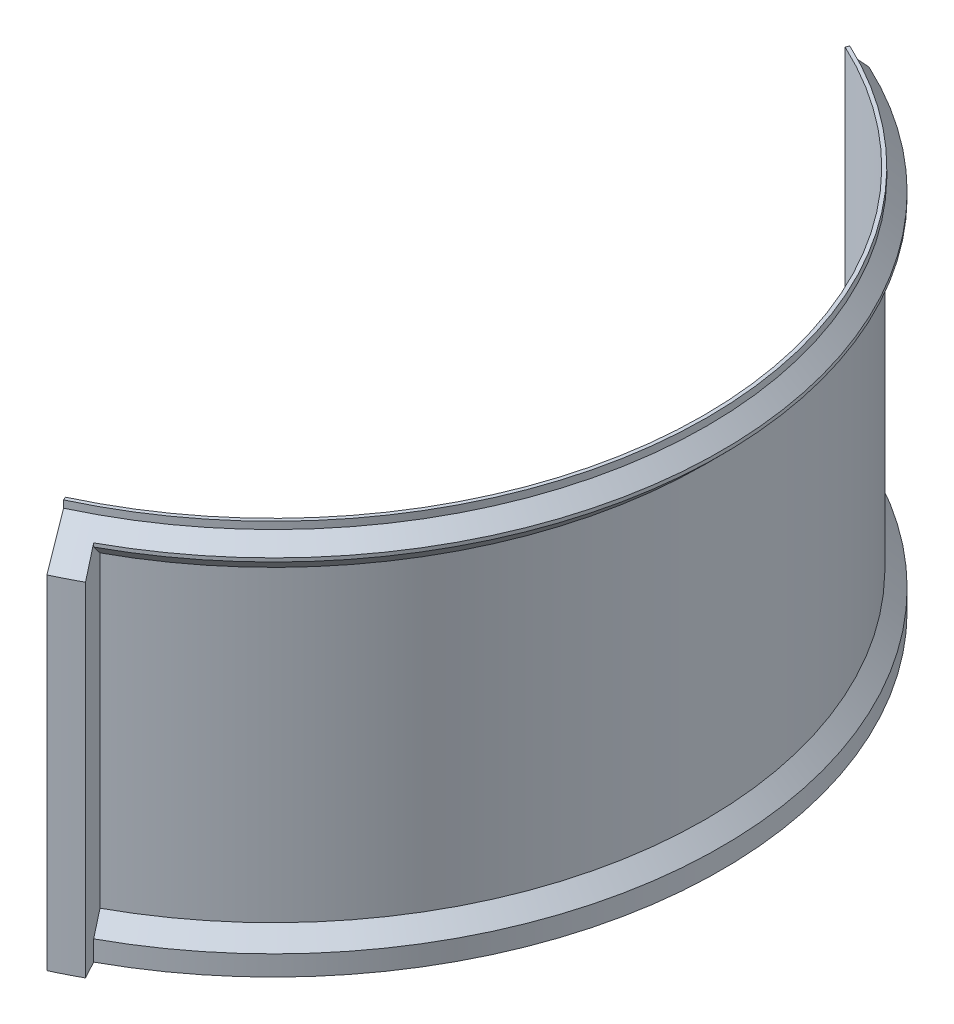
ISO-10303-21;
HEADER;
FILE_DESCRIPTION(('STEP AP214'),'2;1');
FILE_NAME('part.step','',(''),(''),'','','');
FILE_SCHEMA(('AUTOMOTIVE_DESIGN { 1 0 10303 214 1 1 1 1 }'));
ENDSEC;
DATA;
#1=APPLICATION_CONTEXT('core data for automotive mechanical design processes');
#2=APPLICATION_PROTOCOL_DEFINITION('international standard','automotive_design',2000,#1);
#3=PRODUCT_CONTEXT('',#1,'mechanical');
#4=PRODUCT('Part','Part','',(#3));
#5=PRODUCT_RELATED_PRODUCT_CATEGORY('part','',(#4));
#6=PRODUCT_DEFINITION_FORMATION('','',#4);
#7=PRODUCT_DEFINITION_CONTEXT('part definition',#1,'design');
#8=PRODUCT_DEFINITION('design','',#6,#7);
#9=PRODUCT_DEFINITION_SHAPE('','',#8);
#10=(LENGTH_UNIT() NAMED_UNIT(*) SI_UNIT(.MILLI.,.METRE.));
#11=(NAMED_UNIT(*) PLANE_ANGLE_UNIT() SI_UNIT($,.RADIAN.));
#12=(NAMED_UNIT(*) SI_UNIT($,.STERADIAN.) SOLID_ANGLE_UNIT());
#13=UNCERTAINTY_MEASURE_WITH_UNIT(LENGTH_MEASURE(1.E-05),#10,'distance_accuracy_value','');
#14=(GEOMETRIC_REPRESENTATION_CONTEXT(3) GLOBAL_UNCERTAINTY_ASSIGNED_CONTEXT((#13)) GLOBAL_UNIT_ASSIGNED_CONTEXT((#10,
#11,#12)) REPRESENTATION_CONTEXT('',''));
#15=CARTESIAN_POINT('',(0.,0.,0.));
#16=DIRECTION('',(0.,0.,1.));
#17=DIRECTION('',(1.,0.,0.));
#18=AXIS2_PLACEMENT_3D('',#15,#16,#17);
#19=CARTESIAN_POINT('',(0.,-0.199999999999984,0.));
#20=DIRECTION('',(0.,-1.,0.));
#21=DIRECTION('',(0.,0.,-1.));
#22=AXIS2_PLACEMENT_3D('',#19,#20,#21);
#23=CONICAL_SURFACE('',#22,124.66074369328,0.785398163397449);
#24=DIRECTION('',(-0.337615830963898,0.707106781186547,-0.621301497408913));
#25=VECTOR('',#24,1.);
#26=CARTESIAN_POINT('',(0.,124.460743693279,0.));
#27=LINE('',#26,#25);
#28=CARTESIAN_POINT('',(59.5206292604917,-0.199999999999984,109.533536921788));
#29=VERTEX_POINT('',#28);
#30=CARTESIAN_POINT('',(57.4436744019503,4.14999999999999,105.711396354569));
#31=VERTEX_POINT('',#30);
#32=EDGE_CURVE('E267',#29,#31,#27,.T.);
#33=ORIENTED_EDGE('',*,*,#32,.F.);
#34=CARTESIAN_POINT('',(0.,-0.199999999999984,0.));
#35=DIRECTION('',(0.,1.,0.));
#36=DIRECTION('',(0.,0.,1.));
#37=AXIS2_PLACEMENT_3D('',#34,#35,#36);
#38=CIRCLE('',#37,124.66074369328);
#39=CARTESIAN_POINT('',(52.6839068069564,-0.199999999999984,-112.981002746999));
#40=VERTEX_POINT('',#39);
#41=EDGE_CURVE('E361',#29,#40,#38,.T.);
#42=ORIENTED_EDGE('',*,*,#41,.T.);
#43=DIRECTION('',(-0.298836238730119,0.707106781186546,0.640856382055791));
#44=VECTOR('',#43,1.);
#45=CARTESIAN_POINT('',(52.6839068069564,-0.199999999999984,-112.981002746999));
#46=LINE('',#45,#44);
#47=CARTESIAN_POINT('',(52.5993831546083,0.,-112.799741189592));
#48=VERTEX_POINT('',#47);
#49=EDGE_CURVE('E295',#40,#48,#46,.T.);
#50=ORIENTED_EDGE('',*,*,#49,.T.);
#51=CARTESIAN_POINT('',(0.,0.,0.));
#52=DIRECTION('',(0.,1.,0.));
#53=DIRECTION('',(0.,0.,1.));
#54=AXIS2_PLACEMENT_3D('',#51,#52,#53);
#55=CIRCLE('',#54,124.46074369328);
#56=CARTESIAN_POINT('',(59.7297907356549,0.,-109.191706733429));
#57=VERTEX_POINT('',#56);
#58=EDGE_CURVE('E50',#57,#48,#55,.T.);
#59=ORIENTED_EDGE('',*,*,#58,.F.);
#60=DIRECTION('',(0.339346679239839,-0.707106781186547,-0.620357825201629));
#61=VECTOR('',#60,1.);
#62=CARTESIAN_POINT('',(-2.73942883978465E-13,124.460743693279,-1.49851592424521E-13));
#63=LINE('',#62,#61);
#64=CARTESIAN_POINT('',(57.7381697297268,4.14999999999996,-105.550835166243));
#65=VERTEX_POINT('',#64);
#66=EDGE_CURVE('E54',#65,#57,#63,.T.);
#67=ORIENTED_EDGE('',*,*,#66,.F.);
#68=CARTESIAN_POINT('',(0.,4.14999999999996,0.));
#69=DIRECTION('',(0.,-1.,0.));
#70=DIRECTION('',(0.,0.,-1.));
#71=AXIS2_PLACEMENT_3D('',#68,#69,#70);
#72=CIRCLE('',#71,120.31074369328);
#73=CARTESIAN_POINT('',(50.8455173683844,4.15000000000003,-109.03856387339));
#74=VERTEX_POINT('',#73);
#75=EDGE_CURVE('E242',#74,#65,#72,.T.);
#76=ORIENTED_EDGE('',*,*,#75,.F.);
#77=CARTESIAN_POINT('',(50.8243864552973,4.2,-108.993248484038));
#78=VERTEX_POINT('',#77);
#79=EDGE_CURVE('E294',#74,#78,#46,.T.);
#80=ORIENTED_EDGE('',*,*,#79,.T.);
#81=CARTESIAN_POINT('',(0.,4.2,0.));
#82=DIRECTION('',(0.,1.,0.));
#83=DIRECTION('',(0.,0.,1.));
#84=AXIS2_PLACEMENT_3D('',#81,#82,#83);
#85=CIRCLE('',#84,120.26074369328);
#86=CARTESIAN_POINT('',(50.8243864552974,4.2,108.993248484038));
#87=VERTEX_POINT('',#86);
#88=EDGE_CURVE('E358',#87,#78,#85,.T.);
#89=ORIENTED_EDGE('',*,*,#88,.F.);
#90=DIRECTION('',(-0.298836238730119,0.707106781186546,-0.640856382055791));
#91=VECTOR('',#90,1.);
#92=CARTESIAN_POINT('',(52.6839068069564,-0.199999999999984,112.981002746999));
#93=LINE('',#92,#91);
#94=CARTESIAN_POINT('',(50.8455173683844,4.15000000000007,109.03856387339));
#95=VERTEX_POINT('',#94);
#96=EDGE_CURVE('E201',#95,#87,#93,.T.);
#97=ORIENTED_EDGE('',*,*,#96,.F.);
#98=CARTESIAN_POINT('',(0.,4.14999999999999,0.));
#99=DIRECTION('',(0.,-1.,0.));
#100=DIRECTION('',(0.,0.,-1.));
#101=AXIS2_PLACEMENT_3D('',#98,#99,#100);
#102=CIRCLE('',#101,120.31074369328);
#103=EDGE_CURVE('E259',#31,#95,#102,.T.);
#104=ORIENTED_EDGE('',*,*,#103,.F.);
#105=EDGE_LOOP('',(#33,#42,#50,#59,#67,#76,#80,#89,#97,#104));
#106=FACE_BOUND('',#105,.T.);
#107=ADVANCED_FACE('F35',(#106),#23,.T.);
#108=CARTESIAN_POINT('',(0.,0.,0.));
#109=DIRECTION('',(0.,1.,0.));
#110=DIRECTION('',(0.,0.,1.));
#111=AXIS2_PLACEMENT_3D('',#108,#109,#110);
#112=CYLINDRICAL_SURFACE('',#111,124.66074369328);
#113=DIRECTION('',(0.,1.,0.));
#114=VECTOR('',#113,1.);
#115=CARTESIAN_POINT('',(59.5206292604917,0.,109.533536921788));
#116=LINE('',#115,#114);
#117=CARTESIAN_POINT('',(59.5206292604917,-5.8,109.533536921788));
#118=VERTEX_POINT('',#117);
#119=EDGE_CURVE('E217',#118,#29,#116,.T.);
#120=ORIENTED_EDGE('',*,*,#119,.F.);
#121=CARTESIAN_POINT('',(0.,-5.8,0.));
#122=DIRECTION('',(0.,1.,0.));
#123=DIRECTION('',(0.,0.,1.));
#124=AXIS2_PLACEMENT_3D('',#121,#122,#123);
#125=CIRCLE('',#124,124.66074369328);
#126=CARTESIAN_POINT('',(52.6839068069564,-5.8,-112.981002746999));
#127=VERTEX_POINT('',#126);
#128=EDGE_CURVE('E363',#118,#127,#125,.T.);
#129=ORIENTED_EDGE('',*,*,#128,.T.);
#130=DIRECTION('',(0.,1.,0.));
#131=VECTOR('',#130,1.);
#132=CARTESIAN_POINT('',(52.6839068069564,-5.8,-112.981002746999));
#133=LINE('',#132,#131);
#134=EDGE_CURVE('E291',#127,#40,#133,.T.);
#135=ORIENTED_EDGE('',*,*,#134,.T.);
#136=ORIENTED_EDGE('',*,*,#41,.F.);
#137=EDGE_LOOP('',(#120,#129,#135,#136));
#138=FACE_BOUND('',#137,.T.);
#139=ADVANCED_FACE('F418',(#138),#112,.T.);
#140=CARTESIAN_POINT('',(0.,89.8,0.));
#141=DIRECTION('',(0.,1.,0.));
#142=DIRECTION('',(0.,0.,1.));
#143=AXIS2_PLACEMENT_3D('',#140,#141,#142);
#144=CONICAL_SURFACE('',#143,120.26074369328,0.785398163397436);
#145=DIRECTION('',(-0.339346679239835,-0.707106781186557,0.62035782520162));
#146=VECTOR('',#145,1.);
#147=CARTESIAN_POINT('',(-2.73942883978465E-13,-30.4607436932827,-1.49851592424521E-13));
#148=LINE('',#147,#146);
#149=CARTESIAN_POINT('',(59.8257724708803,94.2000000000001,-109.367170423414));
#150=VERTEX_POINT('',#149);
#151=CARTESIAN_POINT('',(57.7381697297268,89.85,-105.550835166242));
#152=VERTEX_POINT('',#151);
#153=EDGE_CURVE('E245',#150,#152,#148,.T.);
#154=ORIENTED_EDGE('',*,*,#153,.F.);
#155=CARTESIAN_POINT('',(0.,94.2000000000001,0.));
#156=DIRECTION('',(0.,1.,0.));
#157=DIRECTION('',(0.,0.,1.));
#158=AXIS2_PLACEMENT_3D('',#155,#156,#157);
#159=CIRCLE('',#158,124.66074369328);
#160=CARTESIAN_POINT('',(59.5206292604917,94.2000000000001,109.533536921788));
#161=VERTEX_POINT('',#160);
#162=EDGE_CURVE('E353',#161,#150,#159,.T.);
#163=ORIENTED_EDGE('',*,*,#162,.F.);
#164=DIRECTION('',(0.337615830963894,0.707106781186557,0.621301497408905));
#165=VECTOR('',#164,1.);
#166=CARTESIAN_POINT('',(0.,-30.4607436932827,0.));
#167=LINE('',#166,#165);
#168=CARTESIAN_POINT('',(57.4436744019503,89.85,105.711396354569));
#169=VERTEX_POINT('',#168);
#170=EDGE_CURVE('E265',#169,#161,#167,.T.);
#171=ORIENTED_EDGE('',*,*,#170,.F.);
#172=CARTESIAN_POINT('',(0.,89.85,0.));
#173=DIRECTION('',(0.,1.,0.));
#174=DIRECTION('',(0.,0.,1.));
#175=AXIS2_PLACEMENT_3D('',#172,#173,#174);
#176=CIRCLE('',#175,120.31074369328);
#177=CARTESIAN_POINT('',(50.8455173683844,89.85,109.03856387339));
#178=VERTEX_POINT('',#177);
#179=EDGE_CURVE('E250',#178,#169,#176,.T.);
#180=ORIENTED_EDGE('',*,*,#179,.F.);
#181=DIRECTION('',(0.298836238730115,0.707106781186555,0.640856382055782));
#182=VECTOR('',#181,1.);
#183=CARTESIAN_POINT('',(50.8243864552974,89.8,108.993248484038));
#184=LINE('',#183,#182);
#185=CARTESIAN_POINT('',(50.8243864552974,89.8,108.993248484038));
#186=VERTEX_POINT('',#185);
#187=EDGE_CURVE('E334',#186,#178,#184,.T.);
#188=ORIENTED_EDGE('',*,*,#187,.F.);
#189=CARTESIAN_POINT('',(0.,89.8,0.));
#190=DIRECTION('',(0.,1.,0.));
#191=DIRECTION('',(0.,0.,1.));
#192=AXIS2_PLACEMENT_3D('',#189,#190,#191);
#193=CIRCLE('',#192,120.26074369328);
#194=CARTESIAN_POINT('',(50.8243864552973,89.8,-108.993248484038));
#195=VERTEX_POINT('',#194);
#196=EDGE_CURVE('E356',#186,#195,#193,.T.);
#197=ORIENTED_EDGE('',*,*,#196,.T.);
#198=DIRECTION('',(0.298836238730115,0.707106781186555,-0.640856382055782));
#199=VECTOR('',#198,1.);
#200=CARTESIAN_POINT('',(50.8243864552973,89.8,-108.993248484038));
#201=LINE('',#200,#199);
#202=CARTESIAN_POINT('',(50.8455173683844,89.85,-109.03856387339));
#203=VERTEX_POINT('',#202);
#204=EDGE_CURVE('E300',#195,#203,#201,.T.);
#205=ORIENTED_EDGE('',*,*,#204,.T.);
#206=CARTESIAN_POINT('',(0.,89.85,0.));
#207=DIRECTION('',(0.,1.,0.));
#208=DIRECTION('',(0.,0.,1.));
#209=AXIS2_PLACEMENT_3D('',#206,#207,#208);
#210=CIRCLE('',#209,120.31074369328);
#211=EDGE_CURVE('E240',#152,#203,#210,.T.);
#212=ORIENTED_EDGE('',*,*,#211,.F.);
#213=EDGE_LOOP('',(#154,#163,#171,#180,#188,#197,#205,#212));
#214=FACE_BOUND('',#213,.T.);
#215=ADVANCED_FACE('F436',(#214),#144,.T.);
#216=CARTESIAN_POINT('',(0.,0.,0.));
#217=DIRECTION('',(0.,1.,0.));
#218=DIRECTION('',(0.,0.,1.));
#219=AXIS2_PLACEMENT_3D('',#216,#217,#218);
#220=CYLINDRICAL_SURFACE('',#219,124.66074369328);
#221=DIRECTION('',(0.,1.,0.));
#222=VECTOR('',#221,1.);
#223=CARTESIAN_POINT('',(52.6839068069564,94.2000000000001,-112.981002746999));
#224=LINE('',#223,#222);
#225=CARTESIAN_POINT('',(52.6839068069564,0.,-112.981002746999));
#226=VERTEX_POINT('',#225);
#227=CARTESIAN_POINT('',(52.6839068069564,95.2000000000001,-112.981002746999));
#228=VERTEX_POINT('',#227);
#229=EDGE_CURVE('E303',#226,#228,#224,.T.);
#230=ORIENTED_EDGE('',*,*,#229,.T.);
#231=CARTESIAN_POINT('',(0.,95.2000000000001,0.));
#232=DIRECTION('',(0.,1.,0.));
#233=DIRECTION('',(0.,0.,1.));
#234=AXIS2_PLACEMENT_3D('',#231,#232,#233);
#235=CIRCLE('',#234,124.66074369328);
#236=CARTESIAN_POINT('',(59.5206292604916,95.2000000000001,109.533536921788));
#237=VERTEX_POINT('',#236);
#238=EDGE_CURVE('E351',#237,#228,#235,.T.);
#239=ORIENTED_EDGE('',*,*,#238,.F.);
#240=DIRECTION('',(0.,1.,0.));
#241=VECTOR('',#240,1.);
#242=CARTESIAN_POINT('',(59.5206292604917,0.,109.533536921788));
#243=LINE('',#242,#241);
#244=EDGE_CURVE('E262',#161,#237,#243,.T.);
#245=ORIENTED_EDGE('',*,*,#244,.F.);
#246=ORIENTED_EDGE('',*,*,#162,.T.);
#247=DIRECTION('',(0.,-1.,0.));
#248=VECTOR('',#247,1.);
#249=CARTESIAN_POINT('',(59.8257724708803,102.557009926228,-109.367170423414));
#250=LINE('',#249,#248);
#251=CARTESIAN_POINT('',(59.8257724708803,0.,-109.367170423414));
#252=VERTEX_POINT('',#251);
#253=EDGE_CURVE('E231',#150,#252,#250,.T.);
#254=ORIENTED_EDGE('',*,*,#253,.T.);
#255=CARTESIAN_POINT('',(0.,0.,0.));
#256=DIRECTION('',(0.,1.,0.));
#257=DIRECTION('',(0.,0.,1.));
#258=AXIS2_PLACEMENT_3D('',#255,#256,#257);
#259=CIRCLE('',#258,124.66074369328);
#260=EDGE_CURVE('E220',#252,#226,#259,.T.);
#261=ORIENTED_EDGE('',*,*,#260,.T.);
#262=EDGE_LOOP('',(#230,#239,#245,#246,#254,#261));
#263=FACE_BOUND('',#262,.T.);
#264=ADVANCED_FACE('F407',(#263),#220,.T.);
#265=CARTESIAN_POINT('',(0.,0.,0.));
#266=DIRECTION('',(0.,1.,0.));
#267=DIRECTION('',(0.,0.,1.));
#268=AXIS2_PLACEMENT_3D('',#265,#266,#267);
#269=CYLINDRICAL_SURFACE('',#268,119.66074369328);
#270=CARTESIAN_POINT('',(0.,-5.8,0.));
#271=DIRECTION('',(0.,1.,0.));
#272=DIRECTION('',(0.,0.,1.));
#273=AXIS2_PLACEMENT_3D('',#270,#271,#272);
#274=CIRCLE('',#273,119.66074369328);
#275=CARTESIAN_POINT('',(50.5708154982529,-5.8,108.449463811816));
#276=VERTEX_POINT('',#275);
#277=CARTESIAN_POINT('',(50.5708154982529,-5.8,-108.449463811816));
#278=VERTEX_POINT('',#277);
#279=EDGE_CURVE('E11',#276,#278,#274,.T.);
#280=ORIENTED_EDGE('',*,*,#279,.F.);
#281=DIRECTION('',(0.,-1.,0.));
#282=VECTOR('',#281,1.);
#283=CARTESIAN_POINT('',(50.5708154982529,101.2,108.449463811816));
#284=LINE('',#283,#282);
#285=CARTESIAN_POINT('',(50.5708154982529,101.2,108.449463811816));
#286=VERTEX_POINT('',#285);
#287=EDGE_CURVE('E315',#286,#276,#284,.T.);
#288=ORIENTED_EDGE('',*,*,#287,.F.);
#289=CARTESIAN_POINT('',(0.,101.2,0.));
#290=DIRECTION('',(0.,1.,0.));
#291=DIRECTION('',(0.,0.,1.));
#292=AXIS2_PLACEMENT_3D('',#289,#290,#291);
#293=CIRCLE('',#292,119.66074369328);
#294=CARTESIAN_POINT('',(50.5708154982529,101.2,-108.449463811816));
#295=VERTEX_POINT('',#294);
#296=EDGE_CURVE('E345',#286,#295,#293,.T.);
#297=ORIENTED_EDGE('',*,*,#296,.T.);
#298=DIRECTION('',(0.,-1.,0.));
#299=VECTOR('',#298,1.);
#300=CARTESIAN_POINT('',(50.5708154982529,101.2,-108.449463811816));
#301=LINE('',#300,#299);
#302=EDGE_CURVE('E270',#295,#278,#301,.T.);
#303=ORIENTED_EDGE('',*,*,#302,.T.);
#304=EDGE_LOOP('',(#280,#288,#297,#303));
#305=FACE_BOUND('',#304,.T.);
#306=ADVANCED_FACE('F392',(#305),#269,.F.);
#307=CARTESIAN_POINT('',(50.5708154982529,-5.8,108.449463811816));
#308=DIRECTION('',(0.,1.,0.));
#309=DIRECTION('',(0.,0.,1.));
#310=AXIS2_PLACEMENT_3D('',#307,#308,#309);
#311=PLANE('',#310);
#312=CARTESIAN_POINT('',(0.,-5.8,0.));
#313=DIRECTION('',(0.,1.,0.));
#314=DIRECTION('',(0.,0.,1.));
#315=AXIS2_PLACEMENT_3D('',#312,#313,#314);
#316=CIRCLE('',#315,120.66074369328);
#317=CARTESIAN_POINT('',(50.9934337599936,-5.8,109.355771598853));
#318=VERTEX_POINT('',#317);
#319=CARTESIAN_POINT('',(50.9934337599936,-5.8,-109.355771598853));
#320=VERTEX_POINT('',#319);
#321=EDGE_CURVE('E43',#318,#320,#316,.T.);
#322=ORIENTED_EDGE('',*,*,#321,.F.);
#323=DIRECTION('',(0.422618261740697,0.,0.906307787036651));
#324=VECTOR('',#323,1.);
#325=CARTESIAN_POINT('',(50.5708154982529,-5.8,108.449463811816));
#326=LINE('',#325,#324);
#327=EDGE_CURVE('E318',#276,#318,#326,.T.);
#328=ORIENTED_EDGE('',*,*,#327,.F.);
#329=ORIENTED_EDGE('',*,*,#279,.T.);
#330=DIRECTION('',(0.422618261740697,0.,-0.906307787036651));
#331=VECTOR('',#330,1.);
#332=CARTESIAN_POINT('',(50.5708154982529,-5.8,-108.449463811816));
#333=LINE('',#332,#331);
#334=EDGE_CURVE('E273',#278,#320,#333,.T.);
#335=ORIENTED_EDGE('',*,*,#334,.T.);
#336=EDGE_LOOP('',(#322,#328,#329,#335));
#337=FACE_BOUND('',#336,.T.);
#338=ADVANCED_FACE('F37',(#337),#311,.F.);
#339=CARTESIAN_POINT('',(0.,0.,0.));
#340=DIRECTION('',(0.,1.,0.));
#341=DIRECTION('',(0.,0.,1.));
#342=AXIS2_PLACEMENT_3D('',#339,#340,#341);
#343=CYLINDRICAL_SURFACE('',#342,120.66074369328);
#344=CARTESIAN_POINT('',(0.,-2.99999999983649,0.));
#345=DIRECTION('',(0.,1.,0.));
#346=DIRECTION('',(0.,0.,1.));
#347=AXIS2_PLACEMENT_3D('',#344,#345,#346);
#348=CIRCLE('',#347,120.66074369328);
#349=CARTESIAN_POINT('',(50.9934337599936,-2.99999999983649,109.355771598853));
#350=VERTEX_POINT('',#349);
#351=CARTESIAN_POINT('',(50.9934337599936,-2.99999999983649,-109.355771598853));
#352=VERTEX_POINT('',#351);
#353=EDGE_CURVE('E371',#350,#352,#348,.T.);
#354=ORIENTED_EDGE('',*,*,#353,.F.);
#355=DIRECTION('',(0.,1.,0.));
#356=VECTOR('',#355,1.);
#357=CARTESIAN_POINT('',(50.9934337599936,-5.8,109.355771598853));
#358=LINE('',#357,#356);
#359=EDGE_CURVE('E321',#318,#350,#358,.T.);
#360=ORIENTED_EDGE('',*,*,#359,.F.);
#361=ORIENTED_EDGE('',*,*,#321,.T.);
#362=DIRECTION('',(0.,1.,0.));
#363=VECTOR('',#362,1.);
#364=CARTESIAN_POINT('',(50.9934337599936,-5.8,-109.355771598853));
#365=LINE('',#364,#363);
#366=EDGE_CURVE('E276',#320,#352,#365,.T.);
#367=ORIENTED_EDGE('',*,*,#366,.T.);
#368=EDGE_LOOP('',(#354,#360,#361,#367));
#369=FACE_BOUND('',#368,.T.);
#370=ADVANCED_FACE('F374',(#369),#343,.T.);
#371=CARTESIAN_POINT('',(0.,-2.99999999983649,0.));
#372=DIRECTION('',(0.,1.,0.));
#373=DIRECTION('',(0.,0.,1.));
#374=AXIS2_PLACEMENT_3D('',#371,#372,#373);
#375=CONICAL_SURFACE('',#374,120.66074369328,0.785398163397441);
#376=CARTESIAN_POINT('',(0.,-1.84999999983653,0.));
#377=DIRECTION('',(0.,1.,0.));
#378=DIRECTION('',(0.,0.,1.));
#379=AXIS2_PLACEMENT_3D('',#376,#377,#378);
#380=CIRCLE('',#379,121.81074369328);
#381=CARTESIAN_POINT('',(51.4794447609954,-1.84999999983653,110.398025553945));
#382=VERTEX_POINT('',#381);
#383=CARTESIAN_POINT('',(51.4794447609954,-1.84999999983653,-110.398025553945));
#384=VERTEX_POINT('',#383);
#385=EDGE_CURVE('E369',#382,#384,#380,.T.);
#386=ORIENTED_EDGE('',*,*,#385,.F.);
#387=DIRECTION('',(0.298836238730116,0.707106781186552,0.640856382055785));
#388=VECTOR('',#387,1.);
#389=CARTESIAN_POINT('',(50.9934337599936,-2.99999999983649,109.355771598853));
#390=LINE('',#389,#388);
#391=EDGE_CURVE('E324',#350,#382,#390,.T.);
#392=ORIENTED_EDGE('',*,*,#391,.F.);
#393=ORIENTED_EDGE('',*,*,#353,.T.);
#394=DIRECTION('',(0.298836238730116,0.707106781186552,-0.640856382055785));
#395=VECTOR('',#394,1.);
#396=CARTESIAN_POINT('',(50.9934337599936,-2.99999999983649,-109.355771598853));
#397=LINE('',#396,#395);
#398=EDGE_CURVE('E279',#352,#384,#397,.T.);
#399=ORIENTED_EDGE('',*,*,#398,.T.);
#400=EDGE_LOOP('',(#386,#392,#393,#399));
#401=FACE_BOUND('',#400,.T.);
#402=ADVANCED_FACE('F386',(#401),#375,.T.);
#403=CARTESIAN_POINT('',(0.,-1.84999999983653,0.));
#404=DIRECTION('',(0.,-1.,0.));
#405=DIRECTION('',(0.,0.,-1.));
#406=AXIS2_PLACEMENT_3D('',#403,#404,#405);
#407=CONICAL_SURFACE('',#406,121.81074369328,0.785398163397468);
#408=CARTESIAN_POINT('',(0.,-2.99999999983645,0.));
#409=DIRECTION('',(0.,1.,0.));
#410=DIRECTION('',(0.,0.,1.));
#411=AXIS2_PLACEMENT_3D('',#408,#409,#410);
#412=CIRCLE('',#411,122.96074369328);
#413=CARTESIAN_POINT('',(51.9654557619972,-2.99999999983645,111.440279509037));
#414=VERTEX_POINT('',#413);
#415=CARTESIAN_POINT('',(51.9654557619972,-2.99999999983645,-111.440279509037));
#416=VERTEX_POINT('',#415);
#417=EDGE_CURVE('E367',#414,#416,#412,.T.);
#418=ORIENTED_EDGE('',*,*,#417,.F.);
#419=DIRECTION('',(0.298836238730124,-0.707106781186534,0.640856382055802));
#420=VECTOR('',#419,1.);
#421=CARTESIAN_POINT('',(51.4794447609954,-1.84999999983653,110.398025553945));
#422=LINE('',#421,#420);
#423=EDGE_CURVE('E327',#382,#414,#422,.T.);
#424=ORIENTED_EDGE('',*,*,#423,.F.);
#425=ORIENTED_EDGE('',*,*,#385,.T.);
#426=DIRECTION('',(0.298836238730124,-0.707106781186534,-0.640856382055802));
#427=VECTOR('',#426,1.);
#428=CARTESIAN_POINT('',(51.4794447609954,-1.84999999983653,-110.398025553945));
#429=LINE('',#428,#427);
#430=EDGE_CURVE('E282',#384,#416,#429,.T.);
#431=ORIENTED_EDGE('',*,*,#430,.T.);
#432=EDGE_LOOP('',(#418,#424,#425,#431));
#433=FACE_BOUND('',#432,.T.);
#434=ADVANCED_FACE('F422',(#433),#407,.F.);
#435=CARTESIAN_POINT('',(0.,0.,0.));
#436=DIRECTION('',(0.,1.,0.));
#437=DIRECTION('',(0.,0.,1.));
#438=AXIS2_PLACEMENT_3D('',#435,#436,#437);
#439=CYLINDRICAL_SURFACE('',#438,122.96074369328);
#440=CARTESIAN_POINT('',(0.,-5.8,0.));
#441=DIRECTION('',(0.,1.,0.));
#442=DIRECTION('',(0.,0.,1.));
#443=AXIS2_PLACEMENT_3D('',#440,#441,#442);
#444=CIRCLE('',#443,122.96074369328);
#445=CARTESIAN_POINT('',(51.9654557619972,-5.8,111.440279509037));
#446=VERTEX_POINT('',#445);
#447=CARTESIAN_POINT('',(51.9654557619972,-5.8,-111.440279509037));
#448=VERTEX_POINT('',#447);
#449=EDGE_CURVE('E365',#446,#448,#444,.T.);
#450=ORIENTED_EDGE('',*,*,#449,.F.);
#451=DIRECTION('',(0.,-1.,0.));
#452=VECTOR('',#451,1.);
#453=CARTESIAN_POINT('',(51.9654557619972,-2.99999999983645,111.440279509037));
#454=LINE('',#453,#452);
#455=EDGE_CURVE('E198',#414,#446,#454,.T.);
#456=ORIENTED_EDGE('',*,*,#455,.F.);
#457=ORIENTED_EDGE('',*,*,#417,.T.);
#458=DIRECTION('',(0.,-1.,0.));
#459=VECTOR('',#458,1.);
#460=CARTESIAN_POINT('',(51.9654557619972,-2.99999999983645,-111.440279509037));
#461=LINE('',#460,#459);
#462=EDGE_CURVE('E285',#416,#448,#461,.T.);
#463=ORIENTED_EDGE('',*,*,#462,.T.);
#464=EDGE_LOOP('',(#450,#456,#457,#463));
#465=FACE_BOUND('',#464,.T.);
#466=ADVANCED_FACE('F420',(#465),#439,.F.);
#467=CARTESIAN_POINT('',(51.9654557619972,-5.8,111.440279509037));
#468=DIRECTION('',(0.,1.,0.));
#469=DIRECTION('',(0.,0.,1.));
#470=AXIS2_PLACEMENT_3D('',#467,#468,#469);
#471=PLANE('',#470);
#472=ORIENTED_EDGE('',*,*,#128,.F.);
#473=DIRECTION('',(-0.477460887021004,0.,-0.878653003958398));
#474=VECTOR('',#473,1.);
#475=CARTESIAN_POINT('',(59.4251370830875,-5.8,109.357806320996));
#476=LINE('',#475,#474);
#477=CARTESIAN_POINT('',(62.2182832721603,-5.8,114.497926394153));
#478=VERTEX_POINT('',#477);
#479=EDGE_CURVE('E216',#478,#118,#476,.T.);
#480=ORIENTED_EDGE('',*,*,#479,.F.);
#481=CARTESIAN_POINT('',(0.,-5.8,0.));
#482=DIRECTION('',(0.,1.,0.));
#483=DIRECTION('',(0.,0.,1.));
#484=AXIS2_PLACEMENT_3D('',#481,#482,#483);
#485=CIRCLE('',#484,130.31074369328);
#486=CARTESIAN_POINT('',(55.0716999857914,-5.8,118.101641743756));
#487=VERTEX_POINT('',#486);
#488=EDGE_CURVE('E207',#487,#478,#485,.T.);
#489=ORIENTED_EDGE('',*,*,#488,.F.);
#490=DIRECTION('',(0.422618261740697,0.,0.906307787036651));
#491=VECTOR('',#490,1.);
#492=CARTESIAN_POINT('',(51.9654557619972,-5.8,111.440279509037));
#493=LINE('',#492,#491);
#494=EDGE_CURVE('E189',#446,#487,#493,.T.);
#495=ORIENTED_EDGE('',*,*,#494,.F.);
#496=ORIENTED_EDGE('',*,*,#449,.T.);
#497=DIRECTION('',(0.422618261740697,0.,-0.906307787036651));
#498=VECTOR('',#497,1.);
#499=CARTESIAN_POINT('',(51.9654557619972,-5.8,-111.440279509037));
#500=LINE('',#499,#498);
#501=EDGE_CURVE('E288',#448,#127,#500,.T.);
#502=ORIENTED_EDGE('',*,*,#501,.T.);
#503=EDGE_LOOP('',(#472,#480,#489,#495,#496,#502));
#504=FACE_BOUND('',#503,.T.);
#505=ADVANCED_FACE('F215',(#504),#471,.F.);
#506=CARTESIAN_POINT('',(0.,0.,0.));
#507=DIRECTION('',(0.,1.,0.));
#508=DIRECTION('',(0.,0.,1.));
#509=AXIS2_PLACEMENT_3D('',#506,#507,#508);
#510=CYLINDRICAL_SURFACE('',#509,120.26074369328);
#511=ORIENTED_EDGE('',*,*,#196,.F.);
#512=DIRECTION('',(0.,1.,0.));
#513=VECTOR('',#512,1.);
#514=CARTESIAN_POINT('',(50.8243864552974,4.2,108.993248484038));
#515=LINE('',#514,#513);
#516=EDGE_CURVE('E331',#87,#186,#515,.T.);
#517=ORIENTED_EDGE('',*,*,#516,.F.);
#518=ORIENTED_EDGE('',*,*,#88,.T.);
#519=DIRECTION('',(0.,1.,0.));
#520=VECTOR('',#519,1.);
#521=CARTESIAN_POINT('',(50.8243864552973,4.2,-108.993248484038));
#522=LINE('',#521,#520);
#523=EDGE_CURVE('E297',#78,#195,#522,.T.);
#524=ORIENTED_EDGE('',*,*,#523,.T.);
#525=EDGE_LOOP('',(#511,#517,#518,#524));
#526=FACE_BOUND('',#525,.T.);
#527=ADVANCED_FACE('F439',(#526),#510,.T.);
#528=CARTESIAN_POINT('',(0.,95.2000000000001,0.));
#529=DIRECTION('',(0.,-1.,0.));
#530=DIRECTION('',(0.,0.,-1.));
#531=AXIS2_PLACEMENT_3D('',#528,#529,#530);
#532=CONICAL_SURFACE('',#531,124.66074369328,0.78539816339745);
#533=DIRECTION('',(-0.298836238730119,0.707106781186546,0.64085638205579));
#534=VECTOR('',#533,1.);
#535=CARTESIAN_POINT('',(52.6839068069564,95.2000000000001,-112.981002746999));
#536=LINE('',#535,#534);
#537=CARTESIAN_POINT('',(50.9934337599936,99.2,-109.355771598853));
#538=VERTEX_POINT('',#537);
#539=EDGE_CURVE('E306',#228,#538,#536,.T.);
#540=ORIENTED_EDGE('',*,*,#539,.T.);
#541=CARTESIAN_POINT('',(0.,99.2,0.));
#542=DIRECTION('',(0.,1.,0.));
#543=DIRECTION('',(0.,0.,1.));
#544=AXIS2_PLACEMENT_3D('',#541,#542,#543);
#545=CIRCLE('',#544,120.66074369328);
#546=CARTESIAN_POINT('',(50.9934337599936,99.2,109.355771598853));
#547=VERTEX_POINT('',#546);
#548=EDGE_CURVE('E349',#547,#538,#545,.T.);
#549=ORIENTED_EDGE('',*,*,#548,.F.);
#550=DIRECTION('',(-0.298836238730119,0.707106781186546,-0.64085638205579));
#551=VECTOR('',#550,1.);
#552=CARTESIAN_POINT('',(52.6839068069564,95.2000000000001,112.981002746999));
#553=LINE('',#552,#551);
#554=CARTESIAN_POINT('',(55.0716999857913,89.5500000000001,118.101641743756));
#555=VERTEX_POINT('',#554);
#556=EDGE_CURVE('E337',#555,#547,#553,.T.);
#557=ORIENTED_EDGE('',*,*,#556,.F.);
#558=CARTESIAN_POINT('',(0.,89.5500000000001,0.));
#559=DIRECTION('',(0.,-1.,0.));
#560=DIRECTION('',(0.,0.,-1.));
#561=AXIS2_PLACEMENT_3D('',#558,#559,#560);
#562=CIRCLE('',#561,130.31074369328);
#563=CARTESIAN_POINT('',(62.2182832721604,89.5499999999999,114.497926394153));
#564=VERTEX_POINT('',#563);
#565=EDGE_CURVE('E209',#564,#555,#562,.T.);
#566=ORIENTED_EDGE('',*,*,#565,.F.);
#567=DIRECTION('',(-0.337615830963898,0.707106781186547,-0.621301497408914));
#568=VECTOR('',#567,1.);
#569=CARTESIAN_POINT('',(0.,219.860743693279,0.));
#570=LINE('',#569,#568);
#571=EDGE_CURVE('E251',#237,#564,#570,.F.);
#572=ORIENTED_EDGE('',*,*,#571,.F.);
#573=ORIENTED_EDGE('',*,*,#238,.T.);
#574=EDGE_LOOP('',(#540,#549,#557,#566,#572,#573));
#575=FACE_BOUND('',#574,.T.);
#576=ADVANCED_FACE('F403',(#575),#532,.T.);
#577=CARTESIAN_POINT('',(0.,0.,0.));
#578=DIRECTION('',(0.,1.,0.));
#579=DIRECTION('',(0.,0.,1.));
#580=AXIS2_PLACEMENT_3D('',#577,#578,#579);
#581=CYLINDRICAL_SURFACE('',#580,120.66074369328);
#582=CARTESIAN_POINT('',(0.,101.2,0.));
#583=DIRECTION('',(0.,1.,0.));
#584=DIRECTION('',(0.,0.,1.));
#585=AXIS2_PLACEMENT_3D('',#582,#583,#584);
#586=CIRCLE('',#585,120.66074369328);
#587=CARTESIAN_POINT('',(50.9934337599936,101.2,109.355771598853));
#588=VERTEX_POINT('',#587);
#589=CARTESIAN_POINT('',(50.9934337599936,101.2,-109.355771598853));
#590=VERTEX_POINT('',#589);
#591=EDGE_CURVE('E347',#588,#590,#586,.T.);
#592=ORIENTED_EDGE('',*,*,#591,.F.);
#593=DIRECTION('',(0.,1.,0.));
#594=VECTOR('',#593,1.);
#595=CARTESIAN_POINT('',(50.9934337599936,99.2,109.355771598853));
#596=LINE('',#595,#594);
#597=EDGE_CURVE('E339',#547,#588,#596,.T.);
#598=ORIENTED_EDGE('',*,*,#597,.F.);
#599=ORIENTED_EDGE('',*,*,#548,.T.);
#600=DIRECTION('',(0.,1.,0.));
#601=VECTOR('',#600,1.);
#602=CARTESIAN_POINT('',(50.9934337599936,99.2,-109.355771598853));
#603=LINE('',#602,#601);
#604=EDGE_CURVE('E309',#538,#590,#603,.T.);
#605=ORIENTED_EDGE('',*,*,#604,.T.);
#606=EDGE_LOOP('',(#592,#598,#599,#605));
#607=FACE_BOUND('',#606,.T.);
#608=ADVANCED_FACE('F399',(#607),#581,.T.);
#609=CARTESIAN_POINT('',(50.9934337599936,101.2,109.355771598853));
#610=DIRECTION('',(0.,-1.,0.));
#611=DIRECTION('',(0.,0.,-1.));
#612=AXIS2_PLACEMENT_3D('',#609,#610,#611);
#613=PLANE('',#612);
#614=DIRECTION('',(-0.422618261740697,0.,-0.906307787036651));
#615=VECTOR('',#614,1.);
#616=CARTESIAN_POINT('',(50.9934337599936,101.2,109.355771598853));
#617=LINE('',#616,#615);
#618=EDGE_CURVE('E342',#588,#286,#617,.T.);
#619=ORIENTED_EDGE('',*,*,#618,.F.);
#620=ORIENTED_EDGE('',*,*,#591,.T.);
#621=DIRECTION('',(-0.422618261740697,0.,0.906307787036651));
#622=VECTOR('',#621,1.);
#623=CARTESIAN_POINT('',(50.9934337599936,101.2,-109.355771598853));
#624=LINE('',#623,#622);
#625=EDGE_CURVE('E312',#590,#295,#624,.T.);
#626=ORIENTED_EDGE('',*,*,#625,.T.);
#627=ORIENTED_EDGE('',*,*,#296,.F.);
#628=EDGE_LOOP('',(#619,#620,#626,#627));
#629=FACE_BOUND('',#628,.T.);
#630=ADVANCED_FACE('F396',(#629),#613,.F.);
#631=CARTESIAN_POINT('',(0.,0.,0.));
#632=DIRECTION('',(-0.906307787036651,0.,0.422618261740697));
#633=DIRECTION('',(0.422618261740697,0.,0.906307787036651));
#634=AXIS2_PLACEMENT_3D('',#631,#632,#633);
#635=PLANE('',#634);
#636=ORIENTED_EDGE('',*,*,#494,.T.);
#637=DIRECTION('',(0.,-1.,0.));
#638=VECTOR('',#637,1.);
#639=CARTESIAN_POINT('',(55.0716999857914,102.557009926228,118.101641743756));
#640=LINE('',#639,#638);
#641=EDGE_CURVE('E194',#555,#487,#640,.T.);
#642=ORIENTED_EDGE('',*,*,#641,.F.);
#643=ORIENTED_EDGE('',*,*,#556,.T.);
#644=ORIENTED_EDGE('',*,*,#597,.T.);
#645=ORIENTED_EDGE('',*,*,#618,.T.);
#646=ORIENTED_EDGE('',*,*,#287,.T.);
#647=ORIENTED_EDGE('',*,*,#327,.T.);
#648=ORIENTED_EDGE('',*,*,#359,.T.);
#649=ORIENTED_EDGE('',*,*,#391,.T.);
#650=ORIENTED_EDGE('',*,*,#423,.T.);
#651=ORIENTED_EDGE('',*,*,#455,.T.);
#652=EDGE_LOOP('',(#636,#642,#643,#644,#645,#646,#647,#648,#649,#650,#651));
#653=FACE_BOUND('',#652,.T.);
#654=DIRECTION('',(0.,-1.,0.));
#655=VECTOR('',#654,1.);
#656=CARTESIAN_POINT('',(50.8455173683844,102.557009926228,109.03856387339));
#657=LINE('',#656,#655);
#658=EDGE_CURVE('E210',#178,#95,#657,.T.);
#659=ORIENTED_EDGE('',*,*,#658,.T.);
#660=ORIENTED_EDGE('',*,*,#96,.T.);
#661=ORIENTED_EDGE('',*,*,#516,.T.);
#662=ORIENTED_EDGE('',*,*,#187,.T.);
#663=EDGE_LOOP('',(#659,#660,#661,#662));
#664=FACE_BOUND('',#663,.T.);
#665=ADVANCED_FACE('F191',(#653,#664),#635,.T.);
#666=CARTESIAN_POINT('',(0.,0.,0.));
#667=DIRECTION('',(0.906307787036651,0.,0.422618261740697));
#668=DIRECTION('',(0.422618261740697,0.,-0.906307787036651));
#669=AXIS2_PLACEMENT_3D('',#666,#667,#668);
#670=PLANE('',#669);
#671=ORIENTED_EDGE('',*,*,#79,.F.);
#672=DIRECTION('',(0.,-1.,0.));
#673=VECTOR('',#672,1.);
#674=CARTESIAN_POINT('',(50.8455173683844,102.557009926228,-109.03856387339));
#675=LINE('',#674,#673);
#676=EDGE_CURVE('E237',#203,#74,#675,.T.);
#677=ORIENTED_EDGE('',*,*,#676,.F.);
#678=ORIENTED_EDGE('',*,*,#204,.F.);
#679=ORIENTED_EDGE('',*,*,#523,.F.);
#680=EDGE_LOOP('',(#671,#677,#678,#679));
#681=FACE_BOUND('',#680,.T.);
#682=ORIENTED_EDGE('',*,*,#229,.F.);
#683=DIRECTION('',(-0.422618261740694,0.,0.906307787036652));
#684=VECTOR('',#683,1.);
#685=CARTESIAN_POINT('',(52.6839068069564,0.,-112.981002746999));
#686=LINE('',#685,#684);
#687=EDGE_CURVE('E226',#226,#48,#686,.T.);
#688=ORIENTED_EDGE('',*,*,#687,.T.);
#689=ORIENTED_EDGE('',*,*,#49,.F.);
#690=ORIENTED_EDGE('',*,*,#134,.F.);
#691=ORIENTED_EDGE('',*,*,#501,.F.);
#692=ORIENTED_EDGE('',*,*,#462,.F.);
#693=ORIENTED_EDGE('',*,*,#430,.F.);
#694=ORIENTED_EDGE('',*,*,#398,.F.);
#695=ORIENTED_EDGE('',*,*,#366,.F.);
#696=ORIENTED_EDGE('',*,*,#334,.F.);
#697=ORIENTED_EDGE('',*,*,#302,.F.);
#698=ORIENTED_EDGE('',*,*,#625,.F.);
#699=ORIENTED_EDGE('',*,*,#604,.F.);
#700=ORIENTED_EDGE('',*,*,#539,.F.);
#701=EDGE_LOOP('',(#682,#688,#689,#690,#691,#692,#693,#694,#695,#696,#697,#698,#699,#700));
#702=FACE_BOUND('',#701,.T.);
#703=ADVANCED_FACE('F382',(#681,#702),#670,.F.);
#704=CARTESIAN_POINT('',(62.2182832721604,102.557009926228,114.497926394153));
#705=DIRECTION('',(-0.878653003958396,0.,0.477460887021006));
#706=DIRECTION('',(0.477460887021007,0.,0.878653003958397));
#707=AXIS2_PLACEMENT_3D('',#704,#705,#706);
#708=PLANE('',#707);
#709=DIRECTION('',(0.,-1.,0.));
#710=VECTOR('',#709,1.);
#711=CARTESIAN_POINT('',(62.2182832721603,102.557009926228,114.497926394153));
#712=LINE('',#711,#710);
#713=EDGE_CURVE('E211',#564,#478,#712,.T.);
#714=ORIENTED_EDGE('',*,*,#713,.T.);
#715=ORIENTED_EDGE('',*,*,#479,.T.);
#716=ORIENTED_EDGE('',*,*,#119,.T.);
#717=ORIENTED_EDGE('',*,*,#32,.T.);
#718=DIRECTION('',(0.,-1.,0.));
#719=VECTOR('',#718,1.);
#720=CARTESIAN_POINT('',(57.4436744019503,102.557009926228,105.711396354569));
#721=LINE('',#720,#719);
#722=EDGE_CURVE('E248',#169,#31,#721,.T.);
#723=ORIENTED_EDGE('',*,*,#722,.F.);
#724=ORIENTED_EDGE('',*,*,#170,.T.);
#725=ORIENTED_EDGE('',*,*,#244,.T.);
#726=ORIENTED_EDGE('',*,*,#571,.T.);
#727=EDGE_LOOP('',(#714,#715,#716,#717,#723,#724,#725,#726));
#728=FACE_BOUND('',#727,.T.);
#729=ADVANCED_FACE('F465',(#728),#708,.F.);
#730=CARTESIAN_POINT('',(0.,102.557009926228,0.));
#731=DIRECTION('',(0.,-1.,0.));
#732=DIRECTION('',(0.,0.,-1.));
#733=AXIS2_PLACEMENT_3D('',#730,#731,#732);
#734=CYLINDRICAL_SURFACE('',#733,120.31074369328);
#735=ORIENTED_EDGE('',*,*,#722,.T.);
#736=ORIENTED_EDGE('',*,*,#103,.T.);
#737=ORIENTED_EDGE('',*,*,#658,.F.);
#738=ORIENTED_EDGE('',*,*,#179,.T.);
#739=EDGE_LOOP('',(#735,#736,#737,#738));
#740=FACE_BOUND('',#739,.T.);
#741=ADVANCED_FACE('F463',(#740),#734,.F.);
#742=CARTESIAN_POINT('',(0.,102.557009926228,0.));
#743=DIRECTION('',(0.,-1.,0.));
#744=DIRECTION('',(0.,0.,-1.));
#745=AXIS2_PLACEMENT_3D('',#742,#743,#744);
#746=CYLINDRICAL_SURFACE('',#745,130.31074369328);
#747=ORIENTED_EDGE('',*,*,#713,.F.);
#748=ORIENTED_EDGE('',*,*,#565,.T.);
#749=ORIENTED_EDGE('',*,*,#641,.T.);
#750=ORIENTED_EDGE('',*,*,#488,.T.);
#751=EDGE_LOOP('',(#747,#748,#749,#750));
#752=FACE_BOUND('',#751,.T.);
#753=ADVANCED_FACE('F206',(#752),#746,.T.);
#754=CARTESIAN_POINT('',(59.8257724708803,102.557009926228,-109.367170423414));
#755=DIRECTION('',(-0.87731844992442,0.,-0.479908676127253));
#756=DIRECTION('',(-0.479908676127253,0.,0.877318449924421));
#757=AXIS2_PLACEMENT_3D('',#754,#755,#756);
#758=PLANE('',#757);
#759=DIRECTION('',(0.,-1.,0.));
#760=VECTOR('',#759,1.);
#761=CARTESIAN_POINT('',(57.7381697297268,102.557009926228,-105.550835166242));
#762=LINE('',#761,#760);
#763=EDGE_CURVE('E234',#152,#65,#762,.T.);
#764=ORIENTED_EDGE('',*,*,#763,.T.);
#765=ORIENTED_EDGE('',*,*,#66,.T.);
#766=DIRECTION('',(0.479908676127253,0.,-0.87731844992442));
#767=VECTOR('',#766,1.);
#768=CARTESIAN_POINT('',(59.8257724708803,0.,-109.367170423414));
#769=LINE('',#768,#767);
#770=EDGE_CURVE('E229',#57,#252,#769,.T.);
#771=ORIENTED_EDGE('',*,*,#770,.T.);
#772=ORIENTED_EDGE('',*,*,#253,.F.);
#773=ORIENTED_EDGE('',*,*,#153,.T.);
#774=EDGE_LOOP('',(#764,#765,#771,#772,#773));
#775=FACE_BOUND('',#774,.T.);
#776=ADVANCED_FACE('F469',(#775),#758,.F.);
#777=CARTESIAN_POINT('',(0.,0.,0.));
#778=DIRECTION('',(0.,1.,0.));
#779=DIRECTION('',(0.,0.,1.));
#780=AXIS2_PLACEMENT_3D('',#777,#778,#779);
#781=PLANE('',#780);
#782=ORIENTED_EDGE('',*,*,#770,.F.);
#783=ORIENTED_EDGE('',*,*,#58,.T.);
#784=ORIENTED_EDGE('',*,*,#687,.F.);
#785=ORIENTED_EDGE('',*,*,#260,.F.);
#786=EDGE_LOOP('',(#782,#783,#784,#785));
#787=FACE_BOUND('',#786,.T.);
#788=ADVANCED_FACE('F411',(#787),#781,.F.);
#789=CARTESIAN_POINT('',(0.,102.557009926228,0.));
#790=DIRECTION('',(0.,-1.,0.));
#791=DIRECTION('',(0.,0.,-1.));
#792=AXIS2_PLACEMENT_3D('',#789,#790,#791);
#793=CYLINDRICAL_SURFACE('',#792,120.31074369328);
#794=ORIENTED_EDGE('',*,*,#676,.T.);
#795=ORIENTED_EDGE('',*,*,#75,.T.);
#796=ORIENTED_EDGE('',*,*,#763,.F.);
#797=ORIENTED_EDGE('',*,*,#211,.T.);
#798=EDGE_LOOP('',(#794,#795,#796,#797));
#799=FACE_BOUND('',#798,.T.);
#800=ADVANCED_FACE('F471',(#799),#793,.F.);
#801=CLOSED_SHELL('',(#107,#139,#215,#264,#306,#338,#370,#402,#434,#466,#505,#527,#576,#608,
#630,#665,#703,#729,#741,#753,#776,#788,#800));
#802=MANIFOLD_SOLID_BREP('B2',#801);
#803=ADVANCED_BREP_SHAPE_REPRESENTATION('',(#18,#802),#14);
#804=SHAPE_DEFINITION_REPRESENTATION(#9,#803);
ENDSEC;
END-ISO-10303-21;
